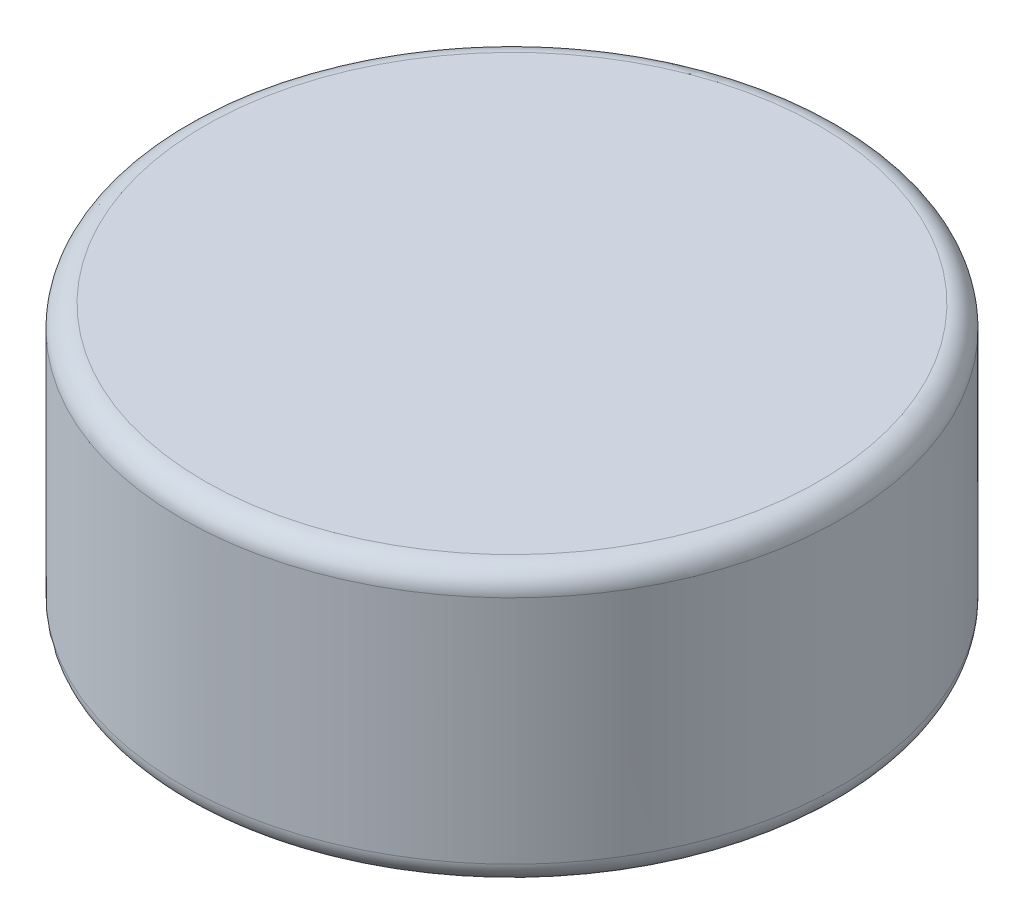
ISO-10303-21;
HEADER;
FILE_DESCRIPTION(('STEP AP214'),'2;1');
FILE_NAME('part.step','',(''),(''),'','','');
FILE_SCHEMA(('AUTOMOTIVE_DESIGN { 1 0 10303 214 1 1 1 1 }'));
ENDSEC;
DATA;
#1=APPLICATION_CONTEXT('core data for automotive mechanical design processes');
#2=APPLICATION_PROTOCOL_DEFINITION('international standard','automotive_design',2000,#1);
#3=PRODUCT_CONTEXT('',#1,'mechanical');
#4=PRODUCT('Part','Part','',(#3));
#5=PRODUCT_RELATED_PRODUCT_CATEGORY('part','',(#4));
#6=PRODUCT_DEFINITION_FORMATION('','',#4);
#7=PRODUCT_DEFINITION_CONTEXT('part definition',#1,'design');
#8=PRODUCT_DEFINITION('design','',#6,#7);
#9=PRODUCT_DEFINITION_SHAPE('','',#8);
#10=(LENGTH_UNIT() NAMED_UNIT(*) SI_UNIT(.MILLI.,.METRE.));
#11=(NAMED_UNIT(*) PLANE_ANGLE_UNIT() SI_UNIT($,.RADIAN.));
#12=(NAMED_UNIT(*) SI_UNIT($,.STERADIAN.) SOLID_ANGLE_UNIT());
#13=UNCERTAINTY_MEASURE_WITH_UNIT(LENGTH_MEASURE(1.E-05),#10,'distance_accuracy_value','');
#14=(GEOMETRIC_REPRESENTATION_CONTEXT(3) GLOBAL_UNCERTAINTY_ASSIGNED_CONTEXT((#13)) GLOBAL_UNIT_ASSIGNED_CONTEXT((#10,
#11,#12)) REPRESENTATION_CONTEXT('',''));
#15=CARTESIAN_POINT('',(0.,0.,0.));
#16=DIRECTION('',(0.,0.,1.));
#17=DIRECTION('',(1.,0.,0.));
#18=AXIS2_PLACEMENT_3D('',#15,#16,#17);
#19=CARTESIAN_POINT('',(0.,0.,0.));
#20=DIRECTION('',(0.,-1.,0.));
#21=DIRECTION('',(0.,0.,-1.));
#22=AXIS2_PLACEMENT_3D('',#19,#20,#21);
#23=PLANE('',#22);
#24=CARTESIAN_POINT('',(0.,0.,0.));
#25=DIRECTION('',(0.,-1.,0.));
#26=DIRECTION('',(0.,0.,-1.));
#27=AXIS2_PLACEMENT_3D('',#24,#25,#26);
#28=CIRCLE('',#27,2.8);
#29=CARTESIAN_POINT('',(0.,0.,-2.8));
#30=VERTEX_POINT('',#29);
#31=EDGE_CURVE('E63',#30,#30,#28,.T.);
#32=ORIENTED_EDGE('',*,*,#31,.T.);
#33=EDGE_LOOP('',(#32));
#34=FACE_BOUND('',#33,.T.);
#35=ADVANCED_FACE('F43',(#34),#23,.T.);
#36=CARTESIAN_POINT('',(0.,0.,0.));
#37=DIRECTION('',(0.,-1.,0.));
#38=DIRECTION('',(0.,0.,-1.));
#39=AXIS2_PLACEMENT_3D('',#36,#37,#38);
#40=CYLINDRICAL_SURFACE('',#39,3.);
#41=CARTESIAN_POINT('',(0.,0.2,0.));
#42=DIRECTION('',(0.,-1.,0.));
#43=DIRECTION('',(0.,0.,-1.));
#44=AXIS2_PLACEMENT_3D('',#41,#42,#43);
#45=CIRCLE('',#44,3.);
#46=CARTESIAN_POINT('',(0.,0.2,-3.));
#47=VERTEX_POINT('',#46);
#48=EDGE_CURVE('E51',#47,#47,#45,.F.);
#49=ORIENTED_EDGE('',*,*,#48,.T.);
#50=EDGE_LOOP('',(#49));
#51=FACE_BOUND('',#50,.T.);
#52=CARTESIAN_POINT('',(0.,2.3,0.));
#53=DIRECTION('',(0.,1.,0.));
#54=DIRECTION('',(0.,0.,1.));
#55=AXIS2_PLACEMENT_3D('',#52,#53,#54);
#56=CIRCLE('',#55,3.);
#57=CARTESIAN_POINT('',(0.,2.3,3.));
#58=VERTEX_POINT('',#57);
#59=EDGE_CURVE('E57',#58,#58,#56,.F.);
#60=ORIENTED_EDGE('',*,*,#59,.T.);
#61=EDGE_LOOP('',(#60));
#62=FACE_BOUND('',#61,.T.);
#63=ADVANCED_FACE('F81',(#51,#62),#40,.T.);
#64=CARTESIAN_POINT('',(3.,2.5,0.));
#65=DIRECTION('',(0.,1.,0.));
#66=DIRECTION('',(0.,0.,1.));
#67=AXIS2_PLACEMENT_3D('',#64,#65,#66);
#68=PLANE('',#67);
#69=CARTESIAN_POINT('',(0.,2.5,0.));
#70=DIRECTION('',(0.,1.,0.));
#71=DIRECTION('',(0.,0.,1.));
#72=AXIS2_PLACEMENT_3D('',#69,#70,#71);
#73=CIRCLE('',#72,2.8);
#74=CARTESIAN_POINT('',(0.,2.5,2.8));
#75=VERTEX_POINT('',#74);
#76=EDGE_CURVE('E10',#75,#75,#73,.T.);
#77=ORIENTED_EDGE('',*,*,#76,.T.);
#78=EDGE_LOOP('',(#77));
#79=FACE_BOUND('',#78,.T.);
#80=ADVANCED_FACE('F74',(#79),#68,.T.);
#81=CARTESIAN_POINT('',(0.,0.2,0.));
#82=DIRECTION('',(0.,-1.,0.));
#83=DIRECTION('',(0.,0.,-1.));
#84=AXIS2_PLACEMENT_3D('',#81,#82,#83);
#85=TOROIDAL_SURFACE('',#84,2.8,0.2);
#86=ORIENTED_EDGE('',*,*,#48,.F.);
#87=EDGE_LOOP('',(#86));
#88=FACE_BOUND('',#87,.T.);
#89=ORIENTED_EDGE('',*,*,#31,.F.);
#90=EDGE_LOOP('',(#89));
#91=FACE_BOUND('',#90,.T.);
#92=ADVANCED_FACE('F72',(#88,#91),#85,.T.);
#93=CARTESIAN_POINT('',(0.,2.3,0.));
#94=DIRECTION('',(0.,1.,0.));
#95=DIRECTION('',(0.,0.,1.));
#96=AXIS2_PLACEMENT_3D('',#93,#94,#95);
#97=TOROIDAL_SURFACE('',#96,2.8,0.2);
#98=ORIENTED_EDGE('',*,*,#76,.F.);
#99=EDGE_LOOP('',(#98));
#100=FACE_BOUND('',#99,.T.);
#101=ORIENTED_EDGE('',*,*,#59,.F.);
#102=EDGE_LOOP('',(#101));
#103=FACE_BOUND('',#102,.T.);
#104=ADVANCED_FACE('F45',(#100,#103),#97,.T.);
#105=CLOSED_SHELL('',(#35,#63,#80,#92,#104));
#106=MANIFOLD_SOLID_BREP('B2',#105);
#107=ADVANCED_BREP_SHAPE_REPRESENTATION('',(#18,#106),#14);
#108=SHAPE_DEFINITION_REPRESENTATION(#9,#107);
ENDSEC;
END-ISO-10303-21;
